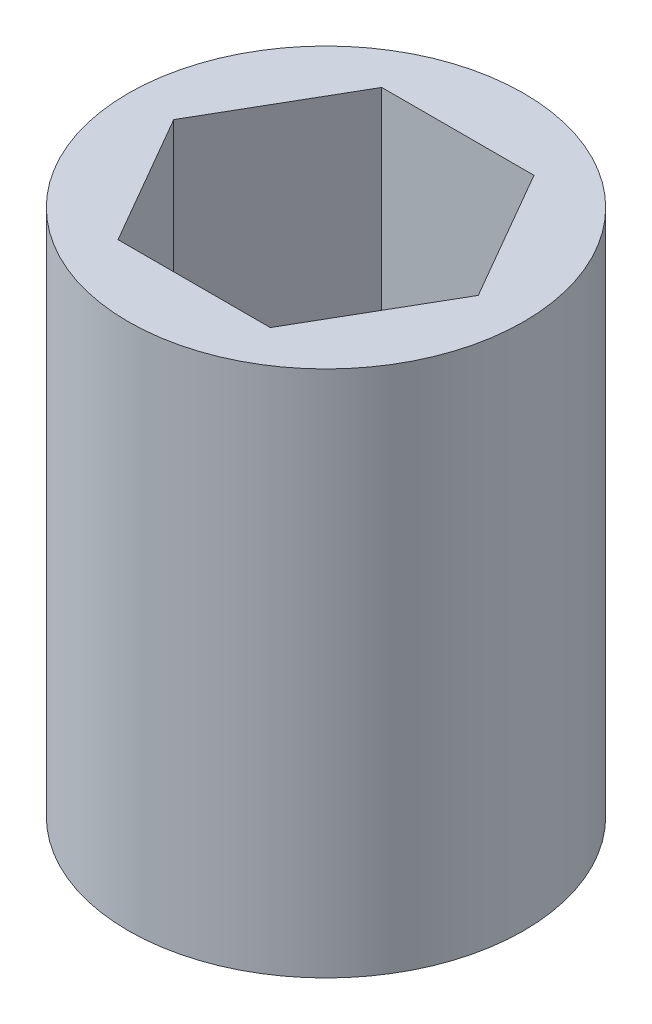
ISO-10303-21;
HEADER;
FILE_DESCRIPTION(('STEP AP214'),'2;1');
FILE_NAME('part.step','',(''),(''),'','','');
FILE_SCHEMA(('AUTOMOTIVE_DESIGN { 1 0 10303 214 1 1 1 1 }'));
ENDSEC;
DATA;
#1=APPLICATION_CONTEXT('core data for automotive mechanical design processes');
#2=APPLICATION_PROTOCOL_DEFINITION('international standard','automotive_design',2000,#1);
#3=PRODUCT_CONTEXT('',#1,'mechanical');
#4=PRODUCT('Part','Part','',(#3));
#5=PRODUCT_RELATED_PRODUCT_CATEGORY('part','',(#4));
#6=PRODUCT_DEFINITION_FORMATION('','',#4);
#7=PRODUCT_DEFINITION_CONTEXT('part definition',#1,'design');
#8=PRODUCT_DEFINITION('design','',#6,#7);
#9=PRODUCT_DEFINITION_SHAPE('','',#8);
#10=(LENGTH_UNIT() NAMED_UNIT(*) SI_UNIT(.MILLI.,.METRE.));
#11=(NAMED_UNIT(*) PLANE_ANGLE_UNIT() SI_UNIT($,.RADIAN.));
#12=(NAMED_UNIT(*) SI_UNIT($,.STERADIAN.) SOLID_ANGLE_UNIT());
#13=UNCERTAINTY_MEASURE_WITH_UNIT(LENGTH_MEASURE(1.E-05),#10,'distance_accuracy_value','');
#14=(GEOMETRIC_REPRESENTATION_CONTEXT(3) GLOBAL_UNCERTAINTY_ASSIGNED_CONTEXT((#13)) GLOBAL_UNIT_ASSIGNED_CONTEXT((#10,
#11,#12)) REPRESENTATION_CONTEXT('',''));
#15=CARTESIAN_POINT('',(0.,0.,0.));
#16=DIRECTION('',(0.,0.,1.));
#17=DIRECTION('',(1.,0.,0.));
#18=AXIS2_PLACEMENT_3D('',#15,#16,#17);
#19=CARTESIAN_POINT('',(0.,25.4,0.));
#20=DIRECTION('',(0.,1.,0.));
#21=DIRECTION('',(0.,0.,1.));
#22=AXIS2_PLACEMENT_3D('',#19,#20,#21);
#23=PLANE('',#22);
#24=CARTESIAN_POINT('',(0.,25.4,0.));
#25=DIRECTION('',(0.,1.,0.));
#26=DIRECTION('',(0.,0.,1.));
#27=AXIS2_PLACEMENT_3D('',#24,#25,#26);
#28=CIRCLE('',#27,9.525);
#29=CARTESIAN_POINT('',(0.,25.4,9.525));
#30=VERTEX_POINT('',#29);
#31=EDGE_CURVE('E11',#30,#30,#28,.T.);
#32=ORIENTED_EDGE('',*,*,#31,.T.);
#33=EDGE_LOOP('',(#32));
#34=FACE_BOUND('',#33,.T.);
#35=DIRECTION('',(-0.5,0.,-0.866025403784439));
#36=VECTOR('',#35,1.);
#37=CARTESIAN_POINT('',(7.33234841870824,25.4,0.));
#38=LINE('',#37,#36);
#39=CARTESIAN_POINT('',(7.33234841870824,25.4,0.));
#40=VERTEX_POINT('',#39);
#41=CARTESIAN_POINT('',(3.66617420935412,25.4,-6.35));
#42=VERTEX_POINT('',#41);
#43=EDGE_CURVE('E108',#40,#42,#38,.T.);
#44=ORIENTED_EDGE('',*,*,#43,.F.);
#45=DIRECTION('',(0.5,0.,-0.866025403784439));
#46=VECTOR('',#45,1.);
#47=CARTESIAN_POINT('',(3.66617420935412,25.4,6.35));
#48=LINE('',#47,#46);
#49=CARTESIAN_POINT('',(3.66617420935412,25.4,6.35));
#50=VERTEX_POINT('',#49);
#51=EDGE_CURVE('E99',#50,#40,#48,.T.);
#52=ORIENTED_EDGE('',*,*,#51,.F.);
#53=DIRECTION('',(1.,0.,0.));
#54=VECTOR('',#53,1.);
#55=CARTESIAN_POINT('',(-3.66617420935412,25.4,6.35));
#56=LINE('',#55,#54);
#57=CARTESIAN_POINT('',(-3.66617420935412,25.4,6.35));
#58=VERTEX_POINT('',#57);
#59=EDGE_CURVE('E133',#58,#50,#56,.T.);
#60=ORIENTED_EDGE('',*,*,#59,.F.);
#61=DIRECTION('',(0.5,0.,0.866025403784439));
#62=VECTOR('',#61,1.);
#63=CARTESIAN_POINT('',(-7.33234841870825,25.4,0.));
#64=LINE('',#63,#62);
#65=CARTESIAN_POINT('',(-7.33234841870825,25.4,0.));
#66=VERTEX_POINT('',#65);
#67=EDGE_CURVE('E130',#66,#58,#64,.T.);
#68=ORIENTED_EDGE('',*,*,#67,.F.);
#69=DIRECTION('',(-0.5,0.,0.866025403784439));
#70=VECTOR('',#69,1.);
#71=CARTESIAN_POINT('',(-3.66617420935412,25.4,-6.35));
#72=LINE('',#71,#70);
#73=CARTESIAN_POINT('',(-3.66617420935412,25.4,-6.35));
#74=VERTEX_POINT('',#73);
#75=EDGE_CURVE('E125',#74,#66,#72,.T.);
#76=ORIENTED_EDGE('',*,*,#75,.F.);
#77=DIRECTION('',(-1.,0.,0.));
#78=VECTOR('',#77,1.);
#79=CARTESIAN_POINT('',(3.66617420935412,25.4,-6.35));
#80=LINE('',#79,#78);
#81=EDGE_CURVE('E121',#42,#74,#80,.T.);
#82=ORIENTED_EDGE('',*,*,#81,.F.);
#83=EDGE_LOOP('',(#44,#52,#60,#68,#76,#82));
#84=FACE_BOUND('',#83,.T.);
#85=ADVANCED_FACE('F45',(#34,#84),#23,.T.);
#86=CARTESIAN_POINT('',(0.,0.,0.));
#87=DIRECTION('',(0.,1.,0.));
#88=DIRECTION('',(0.,0.,1.));
#89=AXIS2_PLACEMENT_3D('',#86,#87,#88);
#90=PLANE('',#89);
#91=CARTESIAN_POINT('',(0.,0.,0.));
#92=DIRECTION('',(0.,1.,0.));
#93=DIRECTION('',(0.,0.,1.));
#94=AXIS2_PLACEMENT_3D('',#91,#92,#93);
#95=CIRCLE('',#94,9.525);
#96=CARTESIAN_POINT('',(0.,0.,9.525));
#97=VERTEX_POINT('',#96);
#98=EDGE_CURVE('E49',#97,#97,#95,.T.);
#99=ORIENTED_EDGE('',*,*,#98,.F.);
#100=EDGE_LOOP('',(#99));
#101=FACE_BOUND('',#100,.T.);
#102=DIRECTION('',(0.5,0.,-0.866025403784439));
#103=VECTOR('',#102,1.);
#104=CARTESIAN_POINT('',(3.66617420935412,0.,6.35));
#105=LINE('',#104,#103);
#106=CARTESIAN_POINT('',(3.66617420935412,0.,6.35));
#107=VERTEX_POINT('',#106);
#108=CARTESIAN_POINT('',(7.33234841870824,0.,0.));
#109=VERTEX_POINT('',#108);
#110=EDGE_CURVE('E69',#107,#109,#105,.T.);
#111=ORIENTED_EDGE('',*,*,#110,.T.);
#112=DIRECTION('',(-0.5,0.,-0.866025403784439));
#113=VECTOR('',#112,1.);
#114=CARTESIAN_POINT('',(7.33234841870824,0.,0.));
#115=LINE('',#114,#113);
#116=CARTESIAN_POINT('',(3.66617420935412,0.,-6.35));
#117=VERTEX_POINT('',#116);
#118=EDGE_CURVE('E115',#109,#117,#115,.T.);
#119=ORIENTED_EDGE('',*,*,#118,.T.);
#120=DIRECTION('',(-1.,0.,0.));
#121=VECTOR('',#120,1.);
#122=CARTESIAN_POINT('',(3.66617420935412,0.,-6.35));
#123=LINE('',#122,#121);
#124=CARTESIAN_POINT('',(-3.66617420935412,0.,-6.35));
#125=VERTEX_POINT('',#124);
#126=EDGE_CURVE('E140',#117,#125,#123,.T.);
#127=ORIENTED_EDGE('',*,*,#126,.T.);
#128=DIRECTION('',(-0.5,0.,0.866025403784439));
#129=VECTOR('',#128,1.);
#130=CARTESIAN_POINT('',(-3.66617420935412,0.,-6.35));
#131=LINE('',#130,#129);
#132=CARTESIAN_POINT('',(-7.33234841870825,0.,0.));
#133=VERTEX_POINT('',#132);
#134=EDGE_CURVE('E144',#125,#133,#131,.T.);
#135=ORIENTED_EDGE('',*,*,#134,.T.);
#136=DIRECTION('',(0.5,0.,0.866025403784439));
#137=VECTOR('',#136,1.);
#138=CARTESIAN_POINT('',(-7.33234841870825,0.,0.));
#139=LINE('',#138,#137);
#140=CARTESIAN_POINT('',(-3.66617420935412,0.,6.35));
#141=VERTEX_POINT('',#140);
#142=EDGE_CURVE('E148',#133,#141,#139,.T.);
#143=ORIENTED_EDGE('',*,*,#142,.T.);
#144=DIRECTION('',(1.,0.,0.));
#145=VECTOR('',#144,1.);
#146=CARTESIAN_POINT('',(-3.66617420935412,0.,6.35));
#147=LINE('',#146,#145);
#148=EDGE_CURVE('E109',#141,#107,#147,.T.);
#149=ORIENTED_EDGE('',*,*,#148,.T.);
#150=EDGE_LOOP('',(#111,#119,#127,#135,#143,#149));
#151=FACE_BOUND('',#150,.T.);
#152=ADVANCED_FACE('F172',(#101,#151),#90,.F.);
#153=CARTESIAN_POINT('',(0.,25.4,0.));
#154=DIRECTION('',(0.,-1.,0.));
#155=DIRECTION('',(0.,0.,-1.));
#156=AXIS2_PLACEMENT_3D('',#153,#154,#155);
#157=CYLINDRICAL_SURFACE('',#156,9.525);
#158=ORIENTED_EDGE('',*,*,#31,.F.);
#159=EDGE_LOOP('',(#158));
#160=FACE_BOUND('',#159,.T.);
#161=ORIENTED_EDGE('',*,*,#98,.T.);
#162=EDGE_LOOP('',(#161));
#163=FACE_BOUND('',#162,.T.);
#164=ADVANCED_FACE('F47',(#160,#163),#157,.T.);
#165=CARTESIAN_POINT('',(3.66617420935412,25.4,6.35));
#166=DIRECTION('',(-0.866025403784439,0.,-0.5));
#167=DIRECTION('',(-0.5,0.,0.866025403784439));
#168=AXIS2_PLACEMENT_3D('',#165,#166,#167);
#169=PLANE('',#168);
#170=ORIENTED_EDGE('',*,*,#110,.F.);
#171=DIRECTION('',(0.,-1.,0.));
#172=VECTOR('',#171,1.);
#173=CARTESIAN_POINT('',(3.66617420935412,25.4,6.35));
#174=LINE('',#173,#172);
#175=EDGE_CURVE('E103',#50,#107,#174,.T.);
#176=ORIENTED_EDGE('',*,*,#175,.F.);
#177=ORIENTED_EDGE('',*,*,#51,.T.);
#178=DIRECTION('',(0.,-1.,0.));
#179=VECTOR('',#178,1.);
#180=CARTESIAN_POINT('',(7.33234841870824,25.4,0.));
#181=LINE('',#180,#179);
#182=EDGE_CURVE('E102',#40,#109,#181,.T.);
#183=ORIENTED_EDGE('',*,*,#182,.T.);
#184=EDGE_LOOP('',(#170,#176,#177,#183));
#185=FACE_BOUND('',#184,.T.);
#186=ADVANCED_FACE('F101',(#185),#169,.T.);
#187=CARTESIAN_POINT('',(7.33234841870824,25.4,0.));
#188=DIRECTION('',(-0.866025403784439,0.,0.5));
#189=DIRECTION('',(0.5,0.,0.866025403784439));
#190=AXIS2_PLACEMENT_3D('',#187,#188,#189);
#191=PLANE('',#190);
#192=ORIENTED_EDGE('',*,*,#118,.F.);
#193=ORIENTED_EDGE('',*,*,#182,.F.);
#194=ORIENTED_EDGE('',*,*,#43,.T.);
#195=DIRECTION('',(0.,-1.,0.));
#196=VECTOR('',#195,1.);
#197=CARTESIAN_POINT('',(3.66617420935412,25.4,-6.35));
#198=LINE('',#197,#196);
#199=EDGE_CURVE('E117',#42,#117,#198,.T.);
#200=ORIENTED_EDGE('',*,*,#199,.T.);
#201=EDGE_LOOP('',(#192,#193,#194,#200));
#202=FACE_BOUND('',#201,.T.);
#203=ADVANCED_FACE('F112',(#202),#191,.T.);
#204=CARTESIAN_POINT('',(3.66617420935412,25.4,-6.35));
#205=DIRECTION('',(0.,0.,1.));
#206=DIRECTION('',(1.,0.,0.));
#207=AXIS2_PLACEMENT_3D('',#204,#205,#206);
#208=PLANE('',#207);
#209=ORIENTED_EDGE('',*,*,#126,.F.);
#210=ORIENTED_EDGE('',*,*,#199,.F.);
#211=ORIENTED_EDGE('',*,*,#81,.T.);
#212=DIRECTION('',(0.,-1.,0.));
#213=VECTOR('',#212,1.);
#214=CARTESIAN_POINT('',(-3.66617420935412,25.4,-6.35));
#215=LINE('',#214,#213);
#216=EDGE_CURVE('E162',#74,#125,#215,.T.);
#217=ORIENTED_EDGE('',*,*,#216,.T.);
#218=EDGE_LOOP('',(#209,#210,#211,#217));
#219=FACE_BOUND('',#218,.T.);
#220=ADVANCED_FACE('F168',(#219),#208,.T.);
#221=CARTESIAN_POINT('',(-3.66617420935412,25.4,-6.35));
#222=DIRECTION('',(0.866025403784439,0.,0.5));
#223=DIRECTION('',(0.5,0.,-0.866025403784439));
#224=AXIS2_PLACEMENT_3D('',#221,#222,#223);
#225=PLANE('',#224);
#226=ORIENTED_EDGE('',*,*,#134,.F.);
#227=ORIENTED_EDGE('',*,*,#216,.F.);
#228=ORIENTED_EDGE('',*,*,#75,.T.);
#229=DIRECTION('',(0.,-1.,0.));
#230=VECTOR('',#229,1.);
#231=CARTESIAN_POINT('',(-7.33234841870825,25.4,0.));
#232=LINE('',#231,#230);
#233=EDGE_CURVE('E159',#66,#133,#232,.T.);
#234=ORIENTED_EDGE('',*,*,#233,.T.);
#235=EDGE_LOOP('',(#226,#227,#228,#234));
#236=FACE_BOUND('',#235,.T.);
#237=ADVANCED_FACE('F180',(#236),#225,.T.);
#238=CARTESIAN_POINT('',(-7.33234841870825,25.4,0.));
#239=DIRECTION('',(0.866025403784439,0.,-0.5));
#240=DIRECTION('',(-0.5,0.,-0.866025403784439));
#241=AXIS2_PLACEMENT_3D('',#238,#239,#240);
#242=PLANE('',#241);
#243=ORIENTED_EDGE('',*,*,#142,.F.);
#244=ORIENTED_EDGE('',*,*,#233,.F.);
#245=ORIENTED_EDGE('',*,*,#67,.T.);
#246=DIRECTION('',(0.,-1.,0.));
#247=VECTOR('',#246,1.);
#248=CARTESIAN_POINT('',(-3.66617420935412,25.4,6.35));
#249=LINE('',#248,#247);
#250=EDGE_CURVE('E61',#58,#141,#249,.T.);
#251=ORIENTED_EDGE('',*,*,#250,.T.);
#252=EDGE_LOOP('',(#243,#244,#245,#251));
#253=FACE_BOUND('',#252,.T.);
#254=ADVANCED_FACE('F178',(#253),#242,.T.);
#255=CARTESIAN_POINT('',(-3.66617420935412,25.4,6.35));
#256=DIRECTION('',(0.,0.,-1.));
#257=DIRECTION('',(-1.,0.,0.));
#258=AXIS2_PLACEMENT_3D('',#255,#256,#257);
#259=PLANE('',#258);
#260=ORIENTED_EDGE('',*,*,#148,.F.);
#261=ORIENTED_EDGE('',*,*,#250,.F.);
#262=ORIENTED_EDGE('',*,*,#59,.T.);
#263=ORIENTED_EDGE('',*,*,#175,.T.);
#264=EDGE_LOOP('',(#260,#261,#262,#263));
#265=FACE_BOUND('',#264,.T.);
#266=ADVANCED_FACE('F174',(#265),#259,.T.);
#267=CLOSED_SHELL('',(#85,#152,#164,#186,#203,#220,#237,#254,#266));
#268=MANIFOLD_SOLID_BREP('B2',#267);
#269=ADVANCED_BREP_SHAPE_REPRESENTATION('',(#18,#268),#14);
#270=SHAPE_DEFINITION_REPRESENTATION(#9,#269);
ENDSEC;
END-ISO-10303-21;
